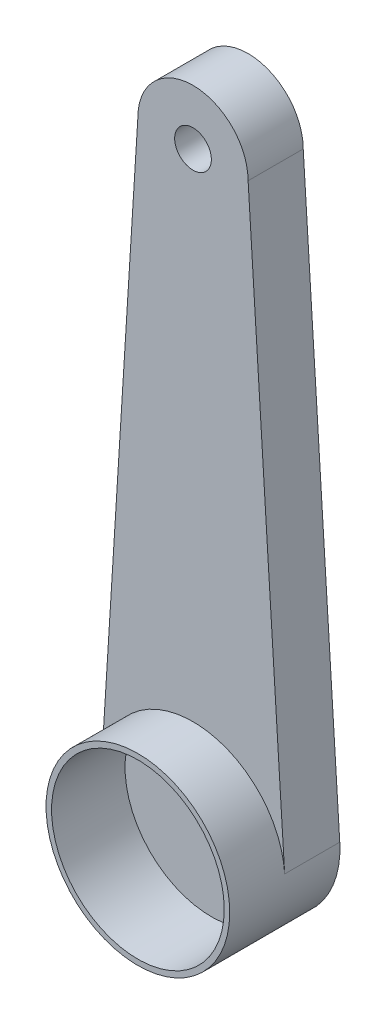
ISO-10303-21;
HEADER;
FILE_DESCRIPTION(('STEP AP214'),'2;1');
FILE_NAME('part.step','',(''),(''),'','','');
FILE_SCHEMA(('AUTOMOTIVE_DESIGN { 1 0 10303 214 1 1 1 1 }'));
ENDSEC;
DATA;
#1=APPLICATION_CONTEXT('core data for automotive mechanical design processes');
#2=APPLICATION_PROTOCOL_DEFINITION('international standard','automotive_design',2000,#1);
#3=PRODUCT_CONTEXT('',#1,'mechanical');
#4=PRODUCT('Part','Part','',(#3));
#5=PRODUCT_RELATED_PRODUCT_CATEGORY('part','',(#4));
#6=PRODUCT_DEFINITION_FORMATION('','',#4);
#7=PRODUCT_DEFINITION_CONTEXT('part definition',#1,'design');
#8=PRODUCT_DEFINITION('design','',#6,#7);
#9=PRODUCT_DEFINITION_SHAPE('','',#8);
#10=(LENGTH_UNIT() NAMED_UNIT(*) SI_UNIT(.MILLI.,.METRE.));
#11=(NAMED_UNIT(*) PLANE_ANGLE_UNIT() SI_UNIT($,.RADIAN.));
#12=(NAMED_UNIT(*) SI_UNIT($,.STERADIAN.) SOLID_ANGLE_UNIT());
#13=UNCERTAINTY_MEASURE_WITH_UNIT(LENGTH_MEASURE(1.E-05),#10,'distance_accuracy_value','');
#14=(GEOMETRIC_REPRESENTATION_CONTEXT(3) GLOBAL_UNCERTAINTY_ASSIGNED_CONTEXT((#13)) GLOBAL_UNIT_ASSIGNED_CONTEXT((#10,
#11,#12)) REPRESENTATION_CONTEXT('',''));
#15=CARTESIAN_POINT('',(0.,0.,0.));
#16=DIRECTION('',(0.,0.,1.));
#17=DIRECTION('',(1.,0.,0.));
#18=AXIS2_PLACEMENT_3D('',#15,#16,#17);
#19=CARTESIAN_POINT('',(0.,16.,1.5));
#20=DIRECTION('',(0.,0.,-1.));
#21=DIRECTION('',(-1.,0.,0.));
#22=AXIS2_PLACEMENT_3D('',#19,#20,#21);
#23=CYLINDRICAL_SURFACE('',#22,1.5);
#24=CARTESIAN_POINT('',(0.,16.,0.));
#25=DIRECTION('',(0.,0.,1.));
#26=DIRECTION('',(1.,0.,0.));
#27=AXIS2_PLACEMENT_3D('',#24,#25,#26);
#28=CIRCLE('',#27,1.5);
#29=CARTESIAN_POINT('',(1.5,16.,0.));
#30=VERTEX_POINT('',#29);
#31=CARTESIAN_POINT('',(-1.5,16.,0.));
#32=VERTEX_POINT('',#31);
#33=EDGE_CURVE('E96',#30,#32,#28,.T.);
#34=ORIENTED_EDGE('',*,*,#33,.T.);
#35=DIRECTION('',(0.,0.,-1.));
#36=VECTOR('',#35,1.);
#37=CARTESIAN_POINT('',(-1.5,16.,1.5));
#38=LINE('',#37,#36);
#39=CARTESIAN_POINT('',(-1.5,16.,1.5));
#40=VERTEX_POINT('',#39);
#41=EDGE_CURVE('E11',#40,#32,#38,.T.);
#42=ORIENTED_EDGE('',*,*,#41,.F.);
#43=CARTESIAN_POINT('',(0.,16.,1.5));
#44=DIRECTION('',(0.,0.,1.));
#45=DIRECTION('',(1.,0.,0.));
#46=AXIS2_PLACEMENT_3D('',#43,#44,#45);
#47=CIRCLE('',#46,1.5);
#48=CARTESIAN_POINT('',(1.5,16.,1.5));
#49=VERTEX_POINT('',#48);
#50=EDGE_CURVE('E103',#49,#40,#47,.T.);
#51=ORIENTED_EDGE('',*,*,#50,.F.);
#52=DIRECTION('',(0.,0.,-1.));
#53=VECTOR('',#52,1.);
#54=CARTESIAN_POINT('',(1.5,16.,1.5));
#55=LINE('',#54,#53);
#56=EDGE_CURVE('E83',#49,#30,#55,.T.);
#57=ORIENTED_EDGE('',*,*,#56,.T.);
#58=EDGE_LOOP('',(#34,#42,#51,#57));
#59=FACE_BOUND('',#58,.T.);
#60=ADVANCED_FACE('F33',(#59),#23,.T.);
#61=CARTESIAN_POINT('',(-1.5,16.,1.5));
#62=DIRECTION('',(0.998033401208909,-0.0626843686366647,0.));
#63=DIRECTION('',(0.0626843686366647,0.998033401208909,0.));
#64=AXIS2_PLACEMENT_3D('',#61,#62,#63);
#65=PLANE('',#64);
#66=DIRECTION('',(-0.0626843686366647,-0.998033401208909,0.));
#67=VECTOR('',#66,1.);
#68=CARTESIAN_POINT('',(-1.5,16.,0.));
#69=LINE('',#68,#67);
#70=CARTESIAN_POINT('',(-2.49508350302227,0.156710921591662,0.));
#71=VERTEX_POINT('',#70);
#72=EDGE_CURVE('E108',#32,#71,#69,.T.);
#73=ORIENTED_EDGE('',*,*,#72,.T.);
#74=DIRECTION('',(0.,0.,-1.));
#75=VECTOR('',#74,1.);
#76=CARTESIAN_POINT('',(-2.49508350302227,0.156710921591662,1.5));
#77=LINE('',#76,#75);
#78=CARTESIAN_POINT('',(-2.49508350302227,0.156710921591662,1.5));
#79=VERTEX_POINT('',#78);
#80=EDGE_CURVE('E42',#79,#71,#77,.T.);
#81=ORIENTED_EDGE('',*,*,#80,.F.);
#82=DIRECTION('',(-0.0626843686366647,-0.998033401208909,0.));
#83=VECTOR('',#82,1.);
#84=CARTESIAN_POINT('',(-1.5,16.,1.5));
#85=LINE('',#84,#83);
#86=EDGE_CURVE('E79',#40,#79,#85,.T.);
#87=ORIENTED_EDGE('',*,*,#86,.F.);
#88=ORIENTED_EDGE('',*,*,#41,.T.);
#89=EDGE_LOOP('',(#73,#81,#87,#88));
#90=FACE_BOUND('',#89,.T.);
#91=ADVANCED_FACE('F118',(#90),#65,.F.);
#92=CARTESIAN_POINT('',(0.,0.,1.5));
#93=DIRECTION('',(0.,0.,-1.));
#94=DIRECTION('',(-1.,0.,0.));
#95=AXIS2_PLACEMENT_3D('',#92,#93,#94);
#96=CYLINDRICAL_SURFACE('',#95,2.5);
#97=CARTESIAN_POINT('',(0.,0.,0.));
#98=DIRECTION('',(0.,0.,1.));
#99=DIRECTION('',(1.,0.,0.));
#100=AXIS2_PLACEMENT_3D('',#97,#98,#99);
#101=CIRCLE('',#100,2.5);
#102=CARTESIAN_POINT('',(2.49508350302227,0.156710921591662,0.));
#103=VERTEX_POINT('',#102);
#104=EDGE_CURVE('E69',#71,#103,#101,.T.);
#105=ORIENTED_EDGE('',*,*,#104,.T.);
#106=DIRECTION('',(0.,0.,-1.));
#107=VECTOR('',#106,1.);
#108=CARTESIAN_POINT('',(2.49508350302227,0.156710921591662,1.5));
#109=LINE('',#108,#107);
#110=CARTESIAN_POINT('',(2.49508350302227,0.156710921591662,1.5));
#111=VERTEX_POINT('',#110);
#112=EDGE_CURVE('E82',#111,#103,#109,.T.);
#113=ORIENTED_EDGE('',*,*,#112,.F.);
#114=CARTESIAN_POINT('',(0.,0.,1.5));
#115=DIRECTION('',(0.,0.,1.));
#116=DIRECTION('',(1.,0.,0.));
#117=AXIS2_PLACEMENT_3D('',#114,#115,#116);
#118=CIRCLE('',#117,2.5);
#119=EDGE_CURVE('E89',#111,#79,#118,.T.);
#120=ORIENTED_EDGE('',*,*,#119,.T.);
#121=ORIENTED_EDGE('',*,*,#80,.T.);
#122=EDGE_LOOP('',(#105,#113,#120,#121));
#123=FACE_BOUND('',#122,.T.);
#124=CARTESIAN_POINT('',(0.,0.,3.));
#125=DIRECTION('',(0.,0.,1.));
#126=DIRECTION('',(1.,0.,0.));
#127=AXIS2_PLACEMENT_3D('',#124,#125,#126);
#128=CIRCLE('',#127,2.5);
#129=CARTESIAN_POINT('',(2.5,0.,3.));
#130=VERTEX_POINT('',#129);
#131=EDGE_CURVE('E92',#130,#130,#128,.T.);
#132=ORIENTED_EDGE('',*,*,#131,.F.);
#133=EDGE_LOOP('',(#132));
#134=FACE_BOUND('',#133,.T.);
#135=ADVANCED_FACE('F87',(#123,#134),#96,.T.);
#136=CARTESIAN_POINT('',(1.5,16.,1.5));
#137=DIRECTION('',(-0.998033401208909,-0.0626843686366647,0.));
#138=DIRECTION('',(0.0626843686366647,-0.998033401208909,0.));
#139=AXIS2_PLACEMENT_3D('',#136,#137,#138);
#140=PLANE('',#139);
#141=DIRECTION('',(-0.0626843686366647,0.998033401208909,0.));
#142=VECTOR('',#141,1.);
#143=CARTESIAN_POINT('',(1.5,16.,0.));
#144=LINE('',#143,#142);
#145=EDGE_CURVE('E74',#103,#30,#144,.T.);
#146=ORIENTED_EDGE('',*,*,#145,.T.);
#147=ORIENTED_EDGE('',*,*,#56,.F.);
#148=DIRECTION('',(-0.0626843686366647,0.998033401208909,0.));
#149=VECTOR('',#148,1.);
#150=CARTESIAN_POINT('',(1.5,16.,1.5));
#151=LINE('',#150,#149);
#152=EDGE_CURVE('E50',#111,#49,#151,.T.);
#153=ORIENTED_EDGE('',*,*,#152,.F.);
#154=ORIENTED_EDGE('',*,*,#112,.T.);
#155=EDGE_LOOP('',(#146,#147,#153,#154));
#156=FACE_BOUND('',#155,.T.);
#157=ADVANCED_FACE('F81',(#156),#140,.F.);
#158=CARTESIAN_POINT('',(0.,16.,1.5));
#159=DIRECTION('',(0.,0.,1.));
#160=DIRECTION('',(1.,0.,0.));
#161=AXIS2_PLACEMENT_3D('',#158,#159,#160);
#162=PLANE('',#161);
#163=CARTESIAN_POINT('',(0.,16.,1.5));
#164=DIRECTION('',(0.,0.,1.));
#165=DIRECTION('',(1.,0.,0.));
#166=AXIS2_PLACEMENT_3D('',#163,#164,#165);
#167=CIRCLE('',#166,0.5);
#168=CARTESIAN_POINT('',(0.5,16.,1.5));
#169=VERTEX_POINT('',#168);
#170=EDGE_CURVE('E154',#169,#169,#167,.T.);
#171=ORIENTED_EDGE('',*,*,#170,.F.);
#172=EDGE_LOOP('',(#171));
#173=FACE_BOUND('',#172,.T.);
#174=ORIENTED_EDGE('',*,*,#119,.F.);
#175=ORIENTED_EDGE('',*,*,#152,.T.);
#176=ORIENTED_EDGE('',*,*,#50,.T.);
#177=ORIENTED_EDGE('',*,*,#86,.T.);
#178=EDGE_LOOP('',(#174,#175,#176,#177));
#179=FACE_BOUND('',#178,.T.);
#180=ADVANCED_FACE('F91',(#173,#179),#162,.T.);
#181=CARTESIAN_POINT('',(0.,16.,0.));
#182=DIRECTION('',(0.,0.,1.));
#183=DIRECTION('',(1.,0.,0.));
#184=AXIS2_PLACEMENT_3D('',#181,#182,#183);
#185=PLANE('',#184);
#186=CARTESIAN_POINT('',(0.,16.,0.));
#187=DIRECTION('',(0.,0.,1.));
#188=DIRECTION('',(1.,0.,0.));
#189=AXIS2_PLACEMENT_3D('',#186,#187,#188);
#190=CIRCLE('',#189,0.5);
#191=CARTESIAN_POINT('',(0.5,16.,0.));
#192=VERTEX_POINT('',#191);
#193=EDGE_CURVE('E36',#192,#192,#190,.T.);
#194=ORIENTED_EDGE('',*,*,#193,.T.);
#195=EDGE_LOOP('',(#194));
#196=FACE_BOUND('',#195,.T.);
#197=ORIENTED_EDGE('',*,*,#33,.F.);
#198=ORIENTED_EDGE('',*,*,#145,.F.);
#199=ORIENTED_EDGE('',*,*,#104,.F.);
#200=ORIENTED_EDGE('',*,*,#72,.F.);
#201=EDGE_LOOP('',(#197,#198,#199,#200));
#202=FACE_BOUND('',#201,.T.);
#203=ADVANCED_FACE('F115',(#196,#202),#185,.F.);
#204=CARTESIAN_POINT('',(0.,0.,3.));
#205=DIRECTION('',(0.,0.,1.));
#206=DIRECTION('',(1.,0.,0.));
#207=AXIS2_PLACEMENT_3D('',#204,#205,#206);
#208=PLANE('',#207);
#209=CARTESIAN_POINT('',(0.,0.,3.));
#210=DIRECTION('',(0.,0.,1.));
#211=DIRECTION('',(1.,0.,0.));
#212=AXIS2_PLACEMENT_3D('',#209,#210,#211);
#213=CIRCLE('',#212,2.35);
#214=CARTESIAN_POINT('',(2.35,0.,3.));
#215=VERTEX_POINT('',#214);
#216=EDGE_CURVE('E99',#215,#215,#213,.T.);
#217=ORIENTED_EDGE('',*,*,#216,.F.);
#218=EDGE_LOOP('',(#217));
#219=FACE_BOUND('',#218,.T.);
#220=ORIENTED_EDGE('',*,*,#131,.T.);
#221=EDGE_LOOP('',(#220));
#222=FACE_BOUND('',#221,.T.);
#223=ADVANCED_FACE('F130',(#219,#222),#208,.T.);
#224=CARTESIAN_POINT('',(0.,0.,1.));
#225=DIRECTION('',(0.,0.,1.));
#226=DIRECTION('',(1.,0.,0.));
#227=AXIS2_PLACEMENT_3D('',#224,#225,#226);
#228=CYLINDRICAL_SURFACE('',#227,2.35);
#229=CARTESIAN_POINT('',(0.,0.,1.));
#230=DIRECTION('',(0.,0.,1.));
#231=DIRECTION('',(1.,0.,0.));
#232=AXIS2_PLACEMENT_3D('',#229,#230,#231);
#233=CIRCLE('',#232,2.35);
#234=CARTESIAN_POINT('',(2.35,0.,1.));
#235=VERTEX_POINT('',#234);
#236=EDGE_CURVE('E93',#235,#235,#233,.T.);
#237=ORIENTED_EDGE('',*,*,#236,.F.);
#238=EDGE_LOOP('',(#237));
#239=FACE_BOUND('',#238,.T.);
#240=ORIENTED_EDGE('',*,*,#216,.T.);
#241=EDGE_LOOP('',(#240));
#242=FACE_BOUND('',#241,.T.);
#243=ADVANCED_FACE('F137',(#239,#242),#228,.F.);
#244=CARTESIAN_POINT('',(0.,0.,1.));
#245=DIRECTION('',(0.,0.,1.));
#246=DIRECTION('',(1.,0.,0.));
#247=AXIS2_PLACEMENT_3D('',#244,#245,#246);
#248=PLANE('',#247);
#249=ORIENTED_EDGE('',*,*,#236,.T.);
#250=EDGE_LOOP('',(#249));
#251=FACE_BOUND('',#250,.T.);
#252=ADVANCED_FACE('F141',(#251),#248,.T.);
#253=CARTESIAN_POINT('',(0.,16.,-0.5));
#254=DIRECTION('',(0.,0.,1.));
#255=DIRECTION('',(1.,0.,0.));
#256=AXIS2_PLACEMENT_3D('',#253,#254,#255);
#257=CYLINDRICAL_SURFACE('',#256,0.5);
#258=ORIENTED_EDGE('',*,*,#170,.T.);
#259=EDGE_LOOP('',(#258));
#260=FACE_BOUND('',#259,.T.);
#261=ORIENTED_EDGE('',*,*,#193,.F.);
#262=EDGE_LOOP('',(#261));
#263=FACE_BOUND('',#262,.T.);
#264=ADVANCED_FACE('F145',(#260,#263),#257,.F.);
#265=CLOSED_SHELL('',(#60,#91,#135,#157,#180,#203,#223,#243,#252,#264));
#266=MANIFOLD_SOLID_BREP('B2',#265);
#267=ADVANCED_BREP_SHAPE_REPRESENTATION('',(#18,#266),#14);
#268=SHAPE_DEFINITION_REPRESENTATION(#9,#267);
ENDSEC;
END-ISO-10303-21;
